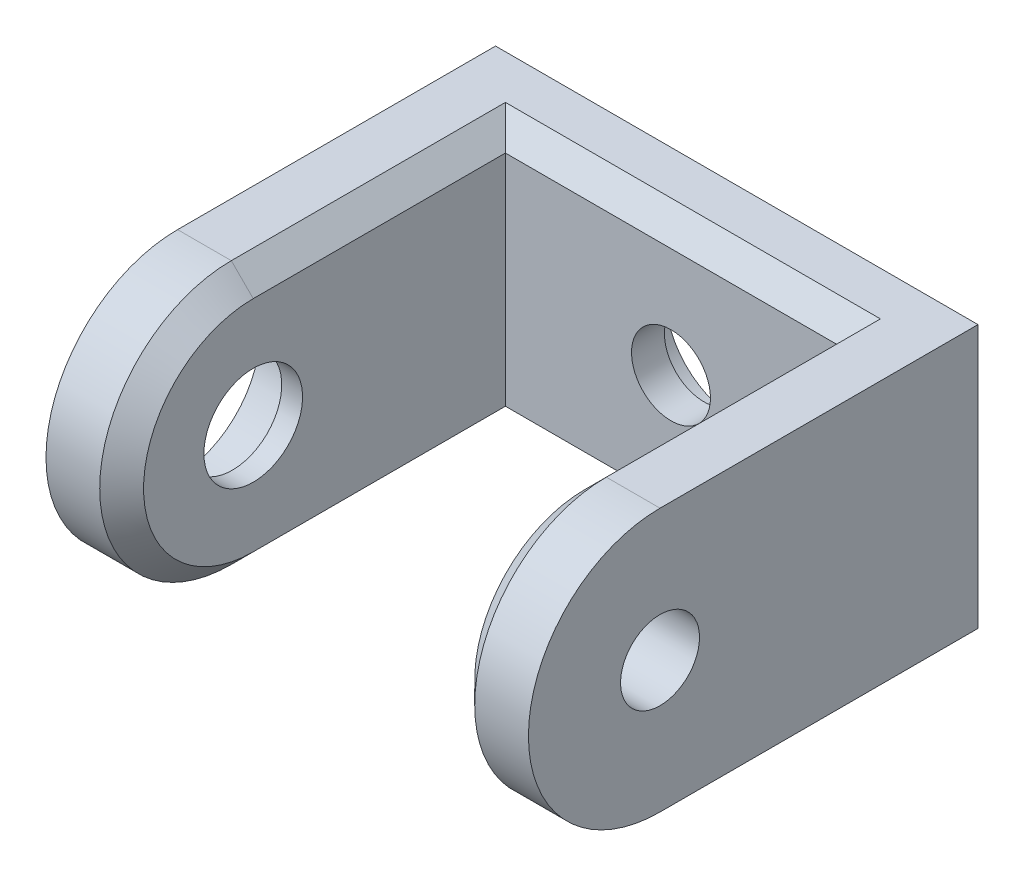
ISO-10303-21;
HEADER;
FILE_DESCRIPTION(('STEP AP214'),'2;1');
FILE_NAME('part.step','',(''),(''),'','','');
FILE_SCHEMA(('AUTOMOTIVE_DESIGN { 1 0 10303 214 1 1 1 1 }'));
ENDSEC;
DATA;
#1=APPLICATION_CONTEXT('core data for automotive mechanical design processes');
#2=APPLICATION_PROTOCOL_DEFINITION('international standard','automotive_design',2000,#1);
#3=PRODUCT_CONTEXT('',#1,'mechanical');
#4=PRODUCT('Part','Part','',(#3));
#5=PRODUCT_RELATED_PRODUCT_CATEGORY('part','',(#4));
#6=PRODUCT_DEFINITION_FORMATION('','',#4);
#7=PRODUCT_DEFINITION_CONTEXT('part definition',#1,'design');
#8=PRODUCT_DEFINITION('design','',#6,#7);
#9=PRODUCT_DEFINITION_SHAPE('','',#8);
#10=(LENGTH_UNIT() NAMED_UNIT(*) SI_UNIT(.MILLI.,.METRE.));
#11=(NAMED_UNIT(*) PLANE_ANGLE_UNIT() SI_UNIT($,.RADIAN.));
#12=(NAMED_UNIT(*) SI_UNIT($,.STERADIAN.) SOLID_ANGLE_UNIT());
#13=UNCERTAINTY_MEASURE_WITH_UNIT(LENGTH_MEASURE(1.E-05),#10,'distance_accuracy_value','');
#14=(GEOMETRIC_REPRESENTATION_CONTEXT(3) GLOBAL_UNCERTAINTY_ASSIGNED_CONTEXT((#13)) GLOBAL_UNIT_ASSIGNED_CONTEXT((#10,
#11,#12)) REPRESENTATION_CONTEXT('',''));
#15=CARTESIAN_POINT('',(0.,0.,0.));
#16=DIRECTION('',(0.,0.,1.));
#17=DIRECTION('',(1.,0.,0.));
#18=AXIS2_PLACEMENT_3D('',#15,#16,#17);
#19=CARTESIAN_POINT('',(-7.55000000000023,1.15251303227707E-13,75.2236151344926));
#20=DIRECTION('',(-1.,0.,0.));
#21=DIRECTION('',(0.,0.,1.));
#22=AXIS2_PLACEMENT_3D('',#19,#20,#21);
#23=CYLINDRICAL_SURFACE('',#22,2.25);
#24=CARTESIAN_POINT('',(-7.55000000000023,1.15251303227707E-13,75.2236151344926));
#25=DIRECTION('',(-1.,0.,0.));
#26=DIRECTION('',(0.,0.,1.));
#27=AXIS2_PLACEMENT_3D('',#24,#25,#26);
#28=CIRCLE('',#27,2.25);
#29=CARTESIAN_POINT('',(-7.55000000000023,1.15251303227707E-13,77.4736151344926));
#30=VERTEX_POINT('',#29);
#31=EDGE_CURVE('E256',#30,#30,#28,.T.);
#32=ORIENTED_EDGE('',*,*,#31,.F.);
#33=EDGE_LOOP('',(#32));
#34=FACE_BOUND('',#33,.T.);
#35=CARTESIAN_POINT('',(-8.50000000000023,1.15145832040368E-13,75.2236151344926));
#36=DIRECTION('',(-1.,0.,0.));
#37=DIRECTION('',(0.,0.,1.));
#38=AXIS2_PLACEMENT_3D('',#35,#36,#37);
#39=CIRCLE('',#38,2.25);
#40=CARTESIAN_POINT('',(-8.50000000000023,1.15145832040368E-13,77.4736151344926));
#41=VERTEX_POINT('',#40);
#42=EDGE_CURVE('E39',#41,#41,#39,.F.);
#43=ORIENTED_EDGE('',*,*,#42,.F.);
#44=EDGE_LOOP('',(#43));
#45=FACE_BOUND('',#44,.T.);
#46=ADVANCED_FACE('F35',(#34,#45),#23,.F.);
#47=CARTESIAN_POINT('',(-7.55000000000023,10.5828871297015,84.7236151344926));
#48=DIRECTION('',(-1.,0.,0.));
#49=DIRECTION('',(0.,-1.,0.));
#50=AXIS2_PLACEMENT_3D('',#47,#48,#49);
#51=PLANE('',#50);
#52=ORIENTED_EDGE('',*,*,#31,.T.);
#53=EDGE_LOOP('',(#52));
#54=FACE_BOUND('',#53,.T.);
#55=DIRECTION('',(0.,1.,0.));
#56=VECTOR('',#55,1.);
#57=CARTESIAN_POINT('',(-7.55000000000023,10.5828871297015,63.7236151344926));
#58=LINE('',#57,#56);
#59=CARTESIAN_POINT('',(-7.55000000000023,-4.99999999999989,63.7236151344926));
#60=VERTEX_POINT('',#59);
#61=CARTESIAN_POINT('',(-7.55000000000023,5.00000000000012,63.7236151344926));
#62=VERTEX_POINT('',#61);
#63=EDGE_CURVE('E206',#60,#62,#58,.T.);
#64=ORIENTED_EDGE('',*,*,#63,.T.);
#65=DIRECTION('',(0.,0.,1.));
#66=VECTOR('',#65,1.);
#67=CARTESIAN_POINT('',(-7.55000000000023,5.00000000000012,84.7236151344926));
#68=LINE('',#67,#66);
#69=CARTESIAN_POINT('',(-7.55000000000023,5.00000000000012,75.2236151344926));
#70=VERTEX_POINT('',#69);
#71=EDGE_CURVE('E158',#62,#70,#68,.T.);
#72=ORIENTED_EDGE('',*,*,#71,.T.);
#73=CARTESIAN_POINT('',(-7.55000000000023,1.15251303227707E-13,75.2236151344926));
#74=DIRECTION('',(-1.,0.,0.));
#75=DIRECTION('',(0.,-1.,0.));
#76=AXIS2_PLACEMENT_3D('',#73,#74,#75);
#77=CIRCLE('',#76,5.);
#78=CARTESIAN_POINT('',(-7.55000000000023,-4.99999999999989,75.2236151344926));
#79=VERTEX_POINT('',#78);
#80=EDGE_CURVE('E148',#70,#79,#77,.F.);
#81=ORIENTED_EDGE('',*,*,#80,.T.);
#82=DIRECTION('',(0.,0.,-1.));
#83=VECTOR('',#82,1.);
#84=CARTESIAN_POINT('',(-7.55000000000023,-4.99999999999989,84.7236151344926));
#85=LINE('',#84,#83);
#86=EDGE_CURVE('E151',#79,#60,#85,.T.);
#87=ORIENTED_EDGE('',*,*,#86,.T.);
#88=EDGE_LOOP('',(#64,#72,#81,#87));
#89=FACE_BOUND('',#88,.T.);
#90=ADVANCED_FACE('F308',(#54,#89),#51,.F.);
#91=CARTESIAN_POINT('',(7.54999999999977,10.5828871297015,84.7236151344926));
#92=DIRECTION('',(1.,0.,0.));
#93=DIRECTION('',(0.,1.,0.));
#94=AXIS2_PLACEMENT_3D('',#91,#92,#93);
#95=PLANE('',#94);
#96=CARTESIAN_POINT('',(7.54999999999977,1.16927739994891E-13,75.2236151344926));
#97=DIRECTION('',(1.,0.,0.));
#98=DIRECTION('',(0.,0.,-1.));
#99=AXIS2_PLACEMENT_3D('',#96,#97,#98);
#100=CIRCLE('',#99,1.79999999999999);
#101=CARTESIAN_POINT('',(7.54999999999977,1.16927739994891E-13,73.4236151344926));
#102=VERTEX_POINT('',#101);
#103=EDGE_CURVE('E249',#102,#102,#100,.T.);
#104=ORIENTED_EDGE('',*,*,#103,.T.);
#105=EDGE_LOOP('',(#104));
#106=FACE_BOUND('',#105,.T.);
#107=DIRECTION('',(0.,-1.,0.));
#108=VECTOR('',#107,1.);
#109=CARTESIAN_POINT('',(7.54999999999977,10.5828871297015,63.7236151344926));
#110=LINE('',#109,#108);
#111=CARTESIAN_POINT('',(7.54999999999977,5.00000000000013,63.7236151344926));
#112=VERTEX_POINT('',#111);
#113=CARTESIAN_POINT('',(7.54999999999977,-4.99999999999989,63.7236151344926));
#114=VERTEX_POINT('',#113);
#115=EDGE_CURVE('E202',#112,#114,#110,.T.);
#116=ORIENTED_EDGE('',*,*,#115,.T.);
#117=DIRECTION('',(0.,0.,1.));
#118=VECTOR('',#117,1.);
#119=CARTESIAN_POINT('',(7.54999999999977,-4.99999999999989,84.7236151344926));
#120=LINE('',#119,#118);
#121=CARTESIAN_POINT('',(7.54999999999977,-4.99999999999989,75.2236151344926));
#122=VERTEX_POINT('',#121);
#123=EDGE_CURVE('E11',#114,#122,#120,.T.);
#124=ORIENTED_EDGE('',*,*,#123,.T.);
#125=CARTESIAN_POINT('',(7.54999999999977,1.16927739994891E-13,75.2236151344926));
#126=DIRECTION('',(1.,0.,0.));
#127=DIRECTION('',(0.,1.,0.));
#128=AXIS2_PLACEMENT_3D('',#125,#126,#127);
#129=CIRCLE('',#128,5.00000000000001);
#130=CARTESIAN_POINT('',(7.54999999999977,5.00000000000013,75.2236151344926));
#131=VERTEX_POINT('',#130);
#132=EDGE_CURVE('E51',#122,#131,#129,.F.);
#133=ORIENTED_EDGE('',*,*,#132,.T.);
#134=DIRECTION('',(0.,0.,-1.));
#135=VECTOR('',#134,1.);
#136=CARTESIAN_POINT('',(7.54999999999977,5.00000000000013,84.7236151344926));
#137=LINE('',#136,#135);
#138=EDGE_CURVE('E44',#131,#112,#137,.T.);
#139=ORIENTED_EDGE('',*,*,#138,.T.);
#140=EDGE_LOOP('',(#116,#124,#133,#139));
#141=FACE_BOUND('',#140,.T.);
#142=ADVANCED_FACE('F314',(#106,#141),#95,.F.);
#143=CARTESIAN_POINT('',(-11.532562594671,6.00000000000012,59.7236151344926));
#144=DIRECTION('',(0.,-1.,0.));
#145=DIRECTION('',(1.,0.,0.));
#146=AXIS2_PLACEMENT_3D('',#143,#144,#145);
#147=PLANE('',#146);
#148=DIRECTION('',(0.,0.,-1.));
#149=VECTOR('',#148,1.);
#150=CARTESIAN_POINT('',(10.9999999999998,6.00000000000012,59.7236151344926));
#151=LINE('',#150,#149);
#152=CARTESIAN_POINT('',(10.9999999999998,6.00000000000013,75.2236151344926));
#153=VERTEX_POINT('',#152);
#154=CARTESIAN_POINT('',(10.9999999999998,6.00000000000013,60.7236151344926));
#155=VERTEX_POINT('',#154);
#156=EDGE_CURVE('E218',#153,#155,#151,.T.);
#157=ORIENTED_EDGE('',*,*,#156,.T.);
#158=DIRECTION('',(-1.,0.,0.));
#159=VECTOR('',#158,1.);
#160=CARTESIAN_POINT('',(17.056465496266,6.00000000000013,60.7236151344926));
#161=LINE('',#160,#159);
#162=CARTESIAN_POINT('',(-11.0000000000002,6.00000000000012,60.7236151344926));
#163=VERTEX_POINT('',#162);
#164=EDGE_CURVE('E143',#155,#163,#161,.T.);
#165=ORIENTED_EDGE('',*,*,#164,.T.);
#166=DIRECTION('',(0.,0.,1.));
#167=VECTOR('',#166,1.);
#168=CARTESIAN_POINT('',(-11.0000000000002,6.00000000000012,59.7236151344926));
#169=LINE('',#168,#167);
#170=CARTESIAN_POINT('',(-11.0000000000002,6.00000000000013,75.2236151344926));
#171=VERTEX_POINT('',#170);
#172=EDGE_CURVE('E131',#163,#171,#169,.T.);
#173=ORIENTED_EDGE('',*,*,#172,.T.);
#174=DIRECTION('',(1.,0.,0.));
#175=VECTOR('',#174,1.);
#176=CARTESIAN_POINT('',(-13.0000000000002,6.00000000000012,75.2236151344926));
#177=LINE('',#176,#175);
#178=CARTESIAN_POINT('',(-8.55000000000023,6.00000000000012,75.2236151344926));
#179=VERTEX_POINT('',#178);
#180=EDGE_CURVE('E196',#171,#179,#177,.T.);
#181=ORIENTED_EDGE('',*,*,#180,.T.);
#182=DIRECTION('',(0.,0.,-1.));
#183=VECTOR('',#182,1.);
#184=CARTESIAN_POINT('',(-8.55000000000023,6.00000000000012,59.7236151344926));
#185=LINE('',#184,#183);
#186=CARTESIAN_POINT('',(-8.55000000000023,6.00000000000012,62.7236151344926));
#187=VERTEX_POINT('',#186);
#188=EDGE_CURVE('E216',#179,#187,#185,.T.);
#189=ORIENTED_EDGE('',*,*,#188,.T.);
#190=DIRECTION('',(1.,0.,0.));
#191=VECTOR('',#190,1.);
#192=CARTESIAN_POINT('',(7.54999999999977,6.00000000000012,62.7236151344926));
#193=LINE('',#192,#191);
#194=CARTESIAN_POINT('',(8.54999999999977,6.00000000000012,62.7236151344926));
#195=VERTEX_POINT('',#194);
#196=EDGE_CURVE('E213',#187,#195,#193,.T.);
#197=ORIENTED_EDGE('',*,*,#196,.T.);
#198=DIRECTION('',(0.,0.,1.));
#199=VECTOR('',#198,1.);
#200=CARTESIAN_POINT('',(8.54999999999977,6.00000000000012,59.7236151344926));
#201=LINE('',#200,#199);
#202=CARTESIAN_POINT('',(8.54999999999976,6.00000000000012,75.2236151344926));
#203=VERTEX_POINT('',#202);
#204=EDGE_CURVE('E211',#195,#203,#201,.T.);
#205=ORIENTED_EDGE('',*,*,#204,.T.);
#206=EDGE_CURVE('E190',#203,#153,#177,.T.);
#207=ORIENTED_EDGE('',*,*,#206,.T.);
#208=EDGE_LOOP('',(#157,#165,#173,#181,#189,#197,#205,#207));
#209=FACE_BOUND('',#208,.T.);
#210=ADVANCED_FACE('F246',(#209),#147,.F.);
#211=CARTESIAN_POINT('',(-2.30527834320716E-13,1.17488742769533E-13,63.7236151344926));
#212=DIRECTION('',(0.,0.,1.));
#213=DIRECTION('',(0.,-1.,0.));
#214=AXIS2_PLACEMENT_3D('',#211,#212,#213);
#215=PLANE('',#214);
#216=CARTESIAN_POINT('',(0.,0.,63.7236151344926));
#217=DIRECTION('',(0.,0.,1.));
#218=DIRECTION('',(1.,0.,0.));
#219=AXIS2_PLACEMENT_3D('',#216,#217,#218);
#220=CIRCLE('',#219,1.8);
#221=CARTESIAN_POINT('',(1.8,0.,63.7236151344926));
#222=VERTEX_POINT('',#221);
#223=EDGE_CURVE('E269',#222,#222,#220,.T.);
#224=ORIENTED_EDGE('',*,*,#223,.F.);
#225=EDGE_LOOP('',(#224));
#226=FACE_BOUND('',#225,.T.);
#227=ORIENTED_EDGE('',*,*,#115,.F.);
#228=DIRECTION('',(-1.,0.,0.));
#229=VECTOR('',#228,1.);
#230=CARTESIAN_POINT('',(-7.55000000000023,5.00000000000012,63.7236151344926));
#231=LINE('',#230,#229);
#232=EDGE_CURVE('E223',#112,#62,#231,.T.);
#233=ORIENTED_EDGE('',*,*,#232,.T.);
#234=ORIENTED_EDGE('',*,*,#63,.F.);
#235=DIRECTION('',(1.,0.,0.));
#236=VECTOR('',#235,1.);
#237=CARTESIAN_POINT('',(7.54999999999977,-4.99999999999988,63.7236151344926));
#238=LINE('',#237,#236);
#239=EDGE_CURVE('E221',#60,#114,#238,.T.);
#240=ORIENTED_EDGE('',*,*,#239,.T.);
#241=EDGE_LOOP('',(#227,#233,#234,#240));
#242=FACE_BOUND('',#241,.T.);
#243=ADVANCED_FACE('F352',(#226,#242),#215,.T.);
#244=CARTESIAN_POINT('',(-11.532562594671,-5.99999999999988,59.7236151344926));
#245=DIRECTION('',(0.,1.,0.));
#246=DIRECTION('',(-1.,0.,0.));
#247=AXIS2_PLACEMENT_3D('',#244,#245,#246);
#248=PLANE('',#247);
#249=DIRECTION('',(0.,0.,-1.));
#250=VECTOR('',#249,1.);
#251=CARTESIAN_POINT('',(-11.0000000000002,-5.99999999999988,59.7236151344926));
#252=LINE('',#251,#250);
#253=CARTESIAN_POINT('',(-11.0000000000002,-5.99999999999989,75.2236151344926));
#254=VERTEX_POINT('',#253);
#255=CARTESIAN_POINT('',(-11.0000000000002,-5.99999999999988,60.7236151344926));
#256=VERTEX_POINT('',#255);
#257=EDGE_CURVE('E128',#254,#256,#252,.T.);
#258=ORIENTED_EDGE('',*,*,#257,.T.);
#259=DIRECTION('',(-1.,0.,0.));
#260=VECTOR('',#259,1.);
#261=CARTESIAN_POINT('',(17.056465496266,-5.99999999999988,60.7236151344926));
#262=LINE('',#261,#260);
#263=CARTESIAN_POINT('',(10.9999999999998,-5.99999999999988,60.7236151344926));
#264=VERTEX_POINT('',#263);
#265=EDGE_CURVE('E135',#264,#256,#262,.T.);
#266=ORIENTED_EDGE('',*,*,#265,.F.);
#267=DIRECTION('',(0.,0.,1.));
#268=VECTOR('',#267,1.);
#269=CARTESIAN_POINT('',(10.9999999999998,-5.99999999999988,59.7236151344926));
#270=LINE('',#269,#268);
#271=CARTESIAN_POINT('',(10.9999999999998,-5.99999999999988,75.2236151344926));
#272=VERTEX_POINT('',#271);
#273=EDGE_CURVE('E149',#264,#272,#270,.T.);
#274=ORIENTED_EDGE('',*,*,#273,.T.);
#275=DIRECTION('',(1.,0.,0.));
#276=VECTOR('',#275,1.);
#277=CARTESIAN_POINT('',(-13.0000000000002,-5.99999999999989,75.2236151344926));
#278=LINE('',#277,#276);
#279=CARTESIAN_POINT('',(8.54999999999976,-5.99999999999988,75.2236151344926));
#280=VERTEX_POINT('',#279);
#281=EDGE_CURVE('E210',#272,#280,#278,.F.);
#282=ORIENTED_EDGE('',*,*,#281,.T.);
#283=DIRECTION('',(0.,0.,-1.));
#284=VECTOR('',#283,1.);
#285=CARTESIAN_POINT('',(8.54999999999977,-5.99999999999988,59.7236151344926));
#286=LINE('',#285,#284);
#287=CARTESIAN_POINT('',(8.54999999999977,-5.99999999999988,62.7236151344926));
#288=VERTEX_POINT('',#287);
#289=EDGE_CURVE('E226',#280,#288,#286,.T.);
#290=ORIENTED_EDGE('',*,*,#289,.T.);
#291=DIRECTION('',(-1.,0.,0.));
#292=VECTOR('',#291,1.);
#293=CARTESIAN_POINT('',(-7.55000000000023,-5.99999999999988,62.7236151344926));
#294=LINE('',#293,#292);
#295=CARTESIAN_POINT('',(-8.55000000000023,-5.99999999999988,62.7236151344926));
#296=VERTEX_POINT('',#295);
#297=EDGE_CURVE('E228',#288,#296,#294,.T.);
#298=ORIENTED_EDGE('',*,*,#297,.T.);
#299=DIRECTION('',(0.,0.,1.));
#300=VECTOR('',#299,1.);
#301=CARTESIAN_POINT('',(-8.55000000000023,-5.99999999999988,59.7236151344926));
#302=LINE('',#301,#300);
#303=CARTESIAN_POINT('',(-8.55000000000023,-5.99999999999989,75.2236151344926));
#304=VERTEX_POINT('',#303);
#305=EDGE_CURVE('E153',#296,#304,#302,.T.);
#306=ORIENTED_EDGE('',*,*,#305,.T.);
#307=EDGE_CURVE('E147',#304,#254,#278,.F.);
#308=ORIENTED_EDGE('',*,*,#307,.T.);
#309=EDGE_LOOP('',(#258,#266,#274,#282,#290,#298,#306,#308));
#310=FACE_BOUND('',#309,.T.);
#311=ADVANCED_FACE('F145',(#310),#248,.F.);
#312=CARTESIAN_POINT('',(-13.0000000000002,1.14646231679286E-13,75.2236151344926));
#313=DIRECTION('',(1.,0.,0.));
#314=DIRECTION('',(0.,1.,0.));
#315=AXIS2_PLACEMENT_3D('',#312,#313,#314);
#316=CYLINDRICAL_SURFACE('',#315,6.);
#317=ORIENTED_EDGE('',*,*,#307,.F.);
#318=CARTESIAN_POINT('',(-8.55000000000023,1.15140280925245E-13,75.2236151344926));
#319=DIRECTION('',(-1.,0.,0.));
#320=DIRECTION('',(0.,-1.,0.));
#321=AXIS2_PLACEMENT_3D('',#318,#319,#320);
#322=CIRCLE('',#321,6.);
#323=EDGE_CURVE('E162',#304,#179,#322,.T.);
#324=ORIENTED_EDGE('',*,*,#323,.T.);
#325=ORIENTED_EDGE('',*,*,#180,.F.);
#326=CARTESIAN_POINT('',(-11.0000000000002,1.14868276284211E-13,75.2236151344926));
#327=DIRECTION('',(1.,0.,0.));
#328=DIRECTION('',(0.,1.,0.));
#329=AXIS2_PLACEMENT_3D('',#326,#327,#328);
#330=CIRCLE('',#329,6.);
#331=EDGE_CURVE('E160',#171,#254,#330,.T.);
#332=ORIENTED_EDGE('',*,*,#331,.T.);
#333=EDGE_LOOP('',(#317,#324,#325,#332));
#334=FACE_BOUND('',#333,.T.);
#335=ADVANCED_FACE('F232',(#334),#316,.T.);
#336=ORIENTED_EDGE('',*,*,#281,.F.);
#337=CARTESIAN_POINT('',(10.9999999999998,1.17310766938387E-13,75.2236151344926));
#338=DIRECTION('',(-1.,0.,0.));
#339=DIRECTION('',(0.,-1.,0.));
#340=AXIS2_PLACEMENT_3D('',#337,#338,#339);
#341=CIRCLE('',#340,6.);
#342=EDGE_CURVE('E166',#272,#153,#341,.T.);
#343=ORIENTED_EDGE('',*,*,#342,.T.);
#344=ORIENTED_EDGE('',*,*,#206,.F.);
#345=CARTESIAN_POINT('',(8.54999999999976,1.17038762297354E-13,75.2236151344926));
#346=DIRECTION('',(1.,0.,0.));
#347=DIRECTION('',(0.,1.,0.));
#348=AXIS2_PLACEMENT_3D('',#345,#346,#347);
#349=CIRCLE('',#348,6.);
#350=EDGE_CURVE('E164',#203,#280,#349,.T.);
#351=ORIENTED_EDGE('',*,*,#350,.T.);
#352=EDGE_LOOP('',(#336,#343,#344,#351));
#353=FACE_BOUND('',#352,.T.);
#354=ADVANCED_FACE('F368',(#353),#316,.T.);
#355=CARTESIAN_POINT('',(-11.532562594671,-5.99999999999989,62.7236151344926));
#356=DIRECTION('',(0.,-0.707106781186546,0.707106781186549));
#357=DIRECTION('',(1.,0.,0.));
#358=AXIS2_PLACEMENT_3D('',#355,#356,#357);
#359=PLANE('',#358);
#360=DIRECTION('',(-0.577350269189629,0.577350269189625,0.577350269189623));
#361=VECTOR('',#360,1.);
#362=CARTESIAN_POINT('',(1.85581246844276,0.694187531557077,69.4178026660495));
#363=LINE('',#362,#361);
#364=EDGE_CURVE('E186',#114,#288,#363,.F.);
#365=ORIENTED_EDGE('',*,*,#364,.F.);
#366=ORIENTED_EDGE('',*,*,#239,.F.);
#367=DIRECTION('',(-0.577350269189626,-0.577350269189627,-0.577350269189625));
#368=VECTOR('',#367,1.);
#369=CARTESIAN_POINT('',(-9.54418753155716,-6.99418753155682,61.7294276029357));
#370=LINE('',#369,#368);
#371=EDGE_CURVE('E188',#296,#60,#370,.F.);
#372=ORIENTED_EDGE('',*,*,#371,.F.);
#373=ORIENTED_EDGE('',*,*,#297,.F.);
#374=EDGE_LOOP('',(#365,#366,#372,#373));
#375=FACE_BOUND('',#374,.T.);
#376=ADVANCED_FACE('F37',(#375),#359,.T.);
#377=CARTESIAN_POINT('',(-7.55000000000023,-4.99999999999989,84.7236151344926));
#378=DIRECTION('',(-0.707106781186548,0.707106781186548,0.));
#379=DIRECTION('',(0.,0.,-1.));
#380=AXIS2_PLACEMENT_3D('',#377,#378,#379);
#381=PLANE('',#380);
#382=ORIENTED_EDGE('',*,*,#371,.T.);
#383=ORIENTED_EDGE('',*,*,#86,.F.);
#384=DIRECTION('',(0.707106781186547,0.707106781186548,0.));
#385=VECTOR('',#384,1.);
#386=CARTESIAN_POINT('',(-8.55000000000023,-5.99999999999989,75.2236151344926));
#387=LINE('',#386,#385);
#388=EDGE_CURVE('E183',#304,#79,#387,.T.);
#389=ORIENTED_EDGE('',*,*,#388,.F.);
#390=ORIENTED_EDGE('',*,*,#305,.F.);
#391=EDGE_LOOP('',(#382,#383,#389,#390));
#392=FACE_BOUND('',#391,.T.);
#393=ADVANCED_FACE('F235',(#392),#381,.F.);
#394=CARTESIAN_POINT('',(7.54999999999977,-4.99999999999989,84.7236151344926));
#395=DIRECTION('',(0.707106781186545,0.70710678118655,0.));
#396=DIRECTION('',(0.,0.,1.));
#397=AXIS2_PLACEMENT_3D('',#394,#395,#396);
#398=PLANE('',#397);
#399=ORIENTED_EDGE('',*,*,#364,.T.);
#400=ORIENTED_EDGE('',*,*,#289,.F.);
#401=DIRECTION('',(0.70710678118655,-0.707106781186545,0.));
#402=VECTOR('',#401,1.);
#403=CARTESIAN_POINT('',(7.54999999999977,-4.99999999999989,75.2236151344926));
#404=LINE('',#403,#402);
#405=EDGE_CURVE('E180',#122,#280,#404,.T.);
#406=ORIENTED_EDGE('',*,*,#405,.F.);
#407=ORIENTED_EDGE('',*,*,#123,.F.);
#408=EDGE_LOOP('',(#399,#400,#406,#407));
#409=FACE_BOUND('',#408,.T.);
#410=ADVANCED_FACE('F374',(#409),#398,.F.);
#411=CARTESIAN_POINT('',(-7.55000000000023,1.15251303227707E-13,75.2236151344926));
#412=DIRECTION('',(-1.,0.,0.));
#413=DIRECTION('',(0.,-1.,0.));
#414=AXIS2_PLACEMENT_3D('',#411,#412,#413);
#415=CONICAL_SURFACE('',#414,5.,0.785398163397448);
#416=ORIENTED_EDGE('',*,*,#388,.T.);
#417=ORIENTED_EDGE('',*,*,#80,.F.);
#418=DIRECTION('',(0.707106781186548,-0.707106781186548,0.));
#419=VECTOR('',#418,1.);
#420=CARTESIAN_POINT('',(-8.55000000000023,6.00000000000012,75.2236151344926));
#421=LINE('',#420,#419);
#422=EDGE_CURVE('E177',#179,#70,#421,.T.);
#423=ORIENTED_EDGE('',*,*,#422,.F.);
#424=ORIENTED_EDGE('',*,*,#323,.F.);
#425=EDGE_LOOP('',(#416,#417,#423,#424));
#426=FACE_BOUND('',#425,.T.);
#427=ADVANCED_FACE('F239',(#426),#415,.T.);
#428=CARTESIAN_POINT('',(7.54999999999977,1.16927739994891E-13,75.2236151344926));
#429=DIRECTION('',(1.,0.,0.));
#430=DIRECTION('',(0.,1.,0.));
#431=AXIS2_PLACEMENT_3D('',#428,#429,#430);
#432=CONICAL_SURFACE('',#431,5.00000000000001,0.785398163397445);
#433=ORIENTED_EDGE('',*,*,#405,.T.);
#434=ORIENTED_EDGE('',*,*,#350,.F.);
#435=DIRECTION('',(0.70710678118655,0.707106781186545,0.));
#436=VECTOR('',#435,1.);
#437=CARTESIAN_POINT('',(7.54999999999977,5.00000000000013,75.2236151344926));
#438=LINE('',#437,#436);
#439=EDGE_CURVE('E174',#131,#203,#438,.T.);
#440=ORIENTED_EDGE('',*,*,#439,.F.);
#441=ORIENTED_EDGE('',*,*,#132,.F.);
#442=EDGE_LOOP('',(#433,#434,#440,#441));
#443=FACE_BOUND('',#442,.T.);
#444=ADVANCED_FACE('F371',(#443),#432,.T.);
#445=CARTESIAN_POINT('',(-7.55000000000023,5.00000000000012,84.7236151344926));
#446=DIRECTION('',(-0.707106781186547,-0.707106781186548,0.));
#447=DIRECTION('',(0.,0.,1.));
#448=AXIS2_PLACEMENT_3D('',#445,#446,#447);
#449=PLANE('',#448);
#450=ORIENTED_EDGE('',*,*,#422,.T.);
#451=ORIENTED_EDGE('',*,*,#71,.F.);
#452=DIRECTION('',(0.577350269189626,-0.577350269189627,0.577350269189624));
#453=VECTOR('',#452,1.);
#454=CARTESIAN_POINT('',(-9.54418753155716,6.99418753155706,61.7294276029357));
#455=LINE('',#454,#453);
#456=EDGE_CURVE('E172',#187,#62,#455,.T.);
#457=ORIENTED_EDGE('',*,*,#456,.F.);
#458=ORIENTED_EDGE('',*,*,#188,.F.);
#459=EDGE_LOOP('',(#450,#451,#457,#458));
#460=FACE_BOUND('',#459,.T.);
#461=ADVANCED_FACE('F244',(#460),#449,.F.);
#462=CARTESIAN_POINT('',(7.54999999999977,5.00000000000013,84.7236151344926));
#463=DIRECTION('',(0.707106781186545,-0.70710678118655,0.));
#464=DIRECTION('',(0.,0.,-1.));
#465=AXIS2_PLACEMENT_3D('',#462,#463,#464);
#466=PLANE('',#465);
#467=ORIENTED_EDGE('',*,*,#439,.T.);
#468=ORIENTED_EDGE('',*,*,#204,.F.);
#469=DIRECTION('',(0.577350269189629,0.577350269189626,-0.577350269189623));
#470=VECTOR('',#469,1.);
#471=CARTESIAN_POINT('',(1.85581246844276,-0.694187531556843,69.4178026660495));
#472=LINE('',#471,#470);
#473=EDGE_CURVE('E170',#112,#195,#472,.T.);
#474=ORIENTED_EDGE('',*,*,#473,.F.);
#475=ORIENTED_EDGE('',*,*,#138,.F.);
#476=EDGE_LOOP('',(#467,#468,#474,#475));
#477=FACE_BOUND('',#476,.T.);
#478=ADVANCED_FACE('F303',(#477),#466,.F.);
#479=CARTESIAN_POINT('',(-11.532562594671,6.00000000000012,62.7236151344926));
#480=DIRECTION('',(0.,0.707106781186546,0.707106781186549));
#481=DIRECTION('',(-1.,0.,0.));
#482=AXIS2_PLACEMENT_3D('',#479,#480,#481);
#483=PLANE('',#482);
#484=ORIENTED_EDGE('',*,*,#456,.T.);
#485=ORIENTED_EDGE('',*,*,#232,.F.);
#486=ORIENTED_EDGE('',*,*,#473,.T.);
#487=ORIENTED_EDGE('',*,*,#196,.F.);
#488=EDGE_LOOP('',(#484,#485,#486,#487));
#489=FACE_BOUND('',#488,.T.);
#490=ADVANCED_FACE('F295',(#489),#483,.T.);
#491=CARTESIAN_POINT('',(17.056465496266,6.00000000000013,60.7236151344926));
#492=DIRECTION('',(0.,0.,1.));
#493=DIRECTION('',(0.,-1.,0.));
#494=AXIS2_PLACEMENT_3D('',#491,#492,#493);
#495=PLANE('',#494);
#496=CARTESIAN_POINT('',(0.,0.,60.7236151344926));
#497=DIRECTION('',(0.,0.,-1.));
#498=DIRECTION('',(0.,1.,0.));
#499=AXIS2_PLACEMENT_3D('',#496,#497,#498);
#500=CIRCLE('',#499,3.25);
#501=CARTESIAN_POINT('',(0.,3.24999999999999,60.7236151344926));
#502=VERTEX_POINT('',#501);
#503=EDGE_CURVE('E266',#502,#502,#500,.T.);
#504=ORIENTED_EDGE('',*,*,#503,.F.);
#505=EDGE_LOOP('',(#504));
#506=FACE_BOUND('',#505,.T.);
#507=ORIENTED_EDGE('',*,*,#265,.T.);
#508=DIRECTION('',(0.,-1.,0.));
#509=VECTOR('',#508,1.);
#510=CARTESIAN_POINT('',(-11.0000000000002,6.00000000000013,60.7236151344926));
#511=LINE('',#510,#509);
#512=EDGE_CURVE('E124',#163,#256,#511,.T.);
#513=ORIENTED_EDGE('',*,*,#512,.F.);
#514=ORIENTED_EDGE('',*,*,#164,.F.);
#515=DIRECTION('',(0.,-1.,0.));
#516=VECTOR('',#515,1.);
#517=CARTESIAN_POINT('',(10.9999999999998,6.00000000000013,60.7236151344926));
#518=LINE('',#517,#516);
#519=EDGE_CURVE('E136',#155,#264,#518,.T.);
#520=ORIENTED_EDGE('',*,*,#519,.T.);
#521=EDGE_LOOP('',(#507,#513,#514,#520));
#522=FACE_BOUND('',#521,.T.);
#523=ADVANCED_FACE('F140',(#506,#522),#495,.F.);
#524=CARTESIAN_POINT('',(10.9999999999998,6.00000000000013,60.7236151344926));
#525=DIRECTION('',(-1.,0.,0.));
#526=DIRECTION('',(0.,0.,1.));
#527=AXIS2_PLACEMENT_3D('',#524,#525,#526);
#528=PLANE('',#527);
#529=CARTESIAN_POINT('',(10.9999999999998,1.17310766938387E-13,75.2236151344926));
#530=DIRECTION('',(1.,0.,0.));
#531=DIRECTION('',(0.,0.,-1.));
#532=AXIS2_PLACEMENT_3D('',#529,#530,#531);
#533=CIRCLE('',#532,1.79999999999999);
#534=CARTESIAN_POINT('',(10.9999999999998,1.17310766938387E-13,73.4236151344926));
#535=VERTEX_POINT('',#534);
#536=EDGE_CURVE('E253',#535,#535,#533,.T.);
#537=ORIENTED_EDGE('',*,*,#536,.F.);
#538=EDGE_LOOP('',(#537));
#539=FACE_BOUND('',#538,.T.);
#540=ORIENTED_EDGE('',*,*,#342,.F.);
#541=ORIENTED_EDGE('',*,*,#273,.F.);
#542=ORIENTED_EDGE('',*,*,#519,.F.);
#543=ORIENTED_EDGE('',*,*,#156,.F.);
#544=EDGE_LOOP('',(#540,#541,#542,#543));
#545=FACE_BOUND('',#544,.T.);
#546=ADVANCED_FACE('F294',(#539,#545),#528,.F.);
#547=CARTESIAN_POINT('',(-11.0000000000002,6.00000000000013,60.7236151344926));
#548=DIRECTION('',(1.,0.,0.));
#549=DIRECTION('',(0.,0.,-1.));
#550=AXIS2_PLACEMENT_3D('',#547,#548,#549);
#551=PLANE('',#550);
#552=CARTESIAN_POINT('',(-11.0000000000002,1.14868276284212E-13,75.2236151344926));
#553=DIRECTION('',(-1.,0.,0.));
#554=DIRECTION('',(0.,0.,1.));
#555=AXIS2_PLACEMENT_3D('',#552,#553,#554);
#556=CIRCLE('',#555,3.74999999999999);
#557=CARTESIAN_POINT('',(-11.0000000000002,1.14868276284212E-13,78.9736151344926));
#558=VERTEX_POINT('',#557);
#559=EDGE_CURVE('E259',#558,#558,#556,.T.);
#560=ORIENTED_EDGE('',*,*,#559,.F.);
#561=EDGE_LOOP('',(#560));
#562=FACE_BOUND('',#561,.T.);
#563=ORIENTED_EDGE('',*,*,#257,.F.);
#564=ORIENTED_EDGE('',*,*,#331,.F.);
#565=ORIENTED_EDGE('',*,*,#172,.F.);
#566=ORIENTED_EDGE('',*,*,#512,.T.);
#567=EDGE_LOOP('',(#563,#564,#565,#566));
#568=FACE_BOUND('',#567,.T.);
#569=ADVANCED_FACE('F126',(#562,#568),#551,.F.);
#570=CARTESIAN_POINT('',(0.999999999999768,1.16200543913762E-13,75.2236151344926));
#571=DIRECTION('',(1.,0.,0.));
#572=DIRECTION('',(0.,0.,-1.));
#573=AXIS2_PLACEMENT_3D('',#570,#571,#572);
#574=CYLINDRICAL_SURFACE('',#573,1.79999999999999);
#575=ORIENTED_EDGE('',*,*,#536,.T.);
#576=EDGE_LOOP('',(#575));
#577=FACE_BOUND('',#576,.T.);
#578=ORIENTED_EDGE('',*,*,#103,.F.);
#579=EDGE_LOOP('',(#578));
#580=FACE_BOUND('',#579,.T.);
#581=ADVANCED_FACE('F322',(#577,#580),#574,.F.);
#582=CARTESIAN_POINT('',(-8.50000000000023,1.15145832040368E-13,75.2236151344926));
#583=DIRECTION('',(-1.,0.,0.));
#584=DIRECTION('',(0.,0.,1.));
#585=AXIS2_PLACEMENT_3D('',#582,#583,#584);
#586=PLANE('',#585);
#587=CARTESIAN_POINT('',(-8.50000000000023,1.15145832040368E-13,75.2236151344926));
#588=DIRECTION('',(-1.,0.,0.));
#589=DIRECTION('',(0.,0.,1.));
#590=AXIS2_PLACEMENT_3D('',#587,#588,#589);
#591=CIRCLE('',#590,3.74999999999999);
#592=CARTESIAN_POINT('',(-8.50000000000023,1.15145832040368E-13,78.9736151344926));
#593=VERTEX_POINT('',#592);
#594=EDGE_CURVE('E262',#593,#593,#591,.T.);
#595=ORIENTED_EDGE('',*,*,#594,.T.);
#596=EDGE_LOOP('',(#595));
#597=FACE_BOUND('',#596,.T.);
#598=ORIENTED_EDGE('',*,*,#42,.T.);
#599=EDGE_LOOP('',(#598));
#600=FACE_BOUND('',#599,.T.);
#601=ADVANCED_FACE('F325',(#597,#600),#586,.T.);
#602=CARTESIAN_POINT('',(-8.50000000000023,1.15145832040368E-13,75.2236151344926));
#603=DIRECTION('',(-1.,0.,0.));
#604=DIRECTION('',(0.,0.,1.));
#605=AXIS2_PLACEMENT_3D('',#602,#603,#604);
#606=CYLINDRICAL_SURFACE('',#605,3.74999999999999);
#607=ORIENTED_EDGE('',*,*,#594,.F.);
#608=EDGE_LOOP('',(#607));
#609=FACE_BOUND('',#608,.T.);
#610=ORIENTED_EDGE('',*,*,#559,.T.);
#611=EDGE_LOOP('',(#610));
#612=FACE_BOUND('',#611,.T.);
#613=ADVANCED_FACE('F284',(#609,#612),#606,.F.);
#614=CARTESIAN_POINT('',(0.,0.,62.2236151344926));
#615=DIRECTION('',(0.,0.,-1.));
#616=DIRECTION('',(0.,1.,0.));
#617=AXIS2_PLACEMENT_3D('',#614,#615,#616);
#618=PLANE('',#617);
#619=CARTESIAN_POINT('',(0.,0.,62.2236151344926));
#620=DIRECTION('',(0.,0.,-1.));
#621=DIRECTION('',(0.,1.,0.));
#622=AXIS2_PLACEMENT_3D('',#619,#620,#621);
#623=CIRCLE('',#622,1.8);
#624=CARTESIAN_POINT('',(0.,1.79999999999999,62.2236151344926));
#625=VERTEX_POINT('',#624);
#626=EDGE_CURVE('E274',#625,#625,#623,.T.);
#627=ORIENTED_EDGE('',*,*,#626,.F.);
#628=EDGE_LOOP('',(#627));
#629=FACE_BOUND('',#628,.T.);
#630=CARTESIAN_POINT('',(0.,0.,62.2236151344926));
#631=DIRECTION('',(0.,0.,-1.));
#632=DIRECTION('',(0.,1.,0.));
#633=AXIS2_PLACEMENT_3D('',#630,#631,#632);
#634=CIRCLE('',#633,3.25);
#635=CARTESIAN_POINT('',(0.,3.24999999999999,62.2236151344926));
#636=VERTEX_POINT('',#635);
#637=EDGE_CURVE('E263',#636,#636,#634,.T.);
#638=ORIENTED_EDGE('',*,*,#637,.T.);
#639=EDGE_LOOP('',(#638));
#640=FACE_BOUND('',#639,.T.);
#641=ADVANCED_FACE('F280',(#629,#640),#618,.T.);
#642=CARTESIAN_POINT('',(0.,0.,62.2236151344926));
#643=DIRECTION('',(0.,0.,-1.));
#644=DIRECTION('',(0.,1.,0.));
#645=AXIS2_PLACEMENT_3D('',#642,#643,#644);
#646=CYLINDRICAL_SURFACE('',#645,3.25);
#647=ORIENTED_EDGE('',*,*,#637,.F.);
#648=EDGE_LOOP('',(#647));
#649=FACE_BOUND('',#648,.T.);
#650=ORIENTED_EDGE('',*,*,#503,.T.);
#651=EDGE_LOOP('',(#650));
#652=FACE_BOUND('',#651,.T.);
#653=ADVANCED_FACE('F283',(#649,#652),#646,.F.);
#654=CARTESIAN_POINT('',(0.,0.,81.2236151344926));
#655=DIRECTION('',(0.,0.,-1.));
#656=DIRECTION('',(0.,1.,0.));
#657=AXIS2_PLACEMENT_3D('',#654,#655,#656);
#658=CYLINDRICAL_SURFACE('',#657,1.8);
#659=ORIENTED_EDGE('',*,*,#223,.T.);
#660=EDGE_LOOP('',(#659));
#661=FACE_BOUND('',#660,.T.);
#662=ORIENTED_EDGE('',*,*,#626,.T.);
#663=EDGE_LOOP('',(#662));
#664=FACE_BOUND('',#663,.T.);
#665=ADVANCED_FACE('F278',(#661,#664),#658,.F.);
#666=CLOSED_SHELL('',(#46,#90,#142,#210,#243,#311,#335,#354,#376,#393,#410,#427,#444,#461,#478,
#490,#523,#546,#569,#581,#601,#613,#641,#653,#665));
#667=MANIFOLD_SOLID_BREP('B2',#666);
#668=ADVANCED_BREP_SHAPE_REPRESENTATION('',(#18,#667),#14);
#669=SHAPE_DEFINITION_REPRESENTATION(#9,#668);
ENDSEC;
END-ISO-10303-21;
